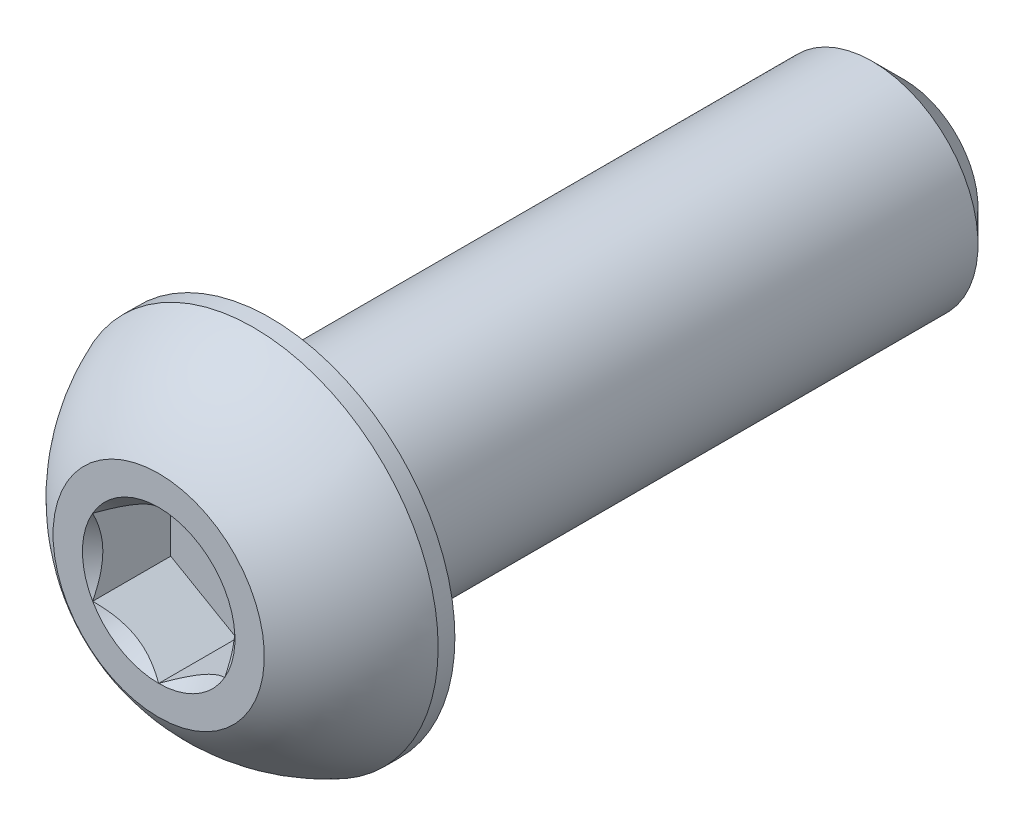
ISO-10303-21;
HEADER;
FILE_DESCRIPTION(('STEP AP214'),'2;1');
FILE_NAME('part.step','',(''),(''),'','','');
FILE_SCHEMA(('AUTOMOTIVE_DESIGN { 1 0 10303 214 1 1 1 1 }'));
ENDSEC;
DATA;
#1=APPLICATION_CONTEXT('core data for automotive mechanical design processes');
#2=APPLICATION_PROTOCOL_DEFINITION('international standard','automotive_design',2000,#1);
#3=PRODUCT_CONTEXT('',#1,'mechanical');
#4=PRODUCT('Part','Part','',(#3));
#5=PRODUCT_RELATED_PRODUCT_CATEGORY('part','',(#4));
#6=PRODUCT_DEFINITION_FORMATION('','',#4);
#7=PRODUCT_DEFINITION_CONTEXT('part definition',#1,'design');
#8=PRODUCT_DEFINITION('design','',#6,#7);
#9=PRODUCT_DEFINITION_SHAPE('','',#8);
#10=(LENGTH_UNIT() NAMED_UNIT(*) SI_UNIT(.MILLI.,.METRE.));
#11=(NAMED_UNIT(*) PLANE_ANGLE_UNIT() SI_UNIT($,.RADIAN.));
#12=(NAMED_UNIT(*) SI_UNIT($,.STERADIAN.) SOLID_ANGLE_UNIT());
#13=UNCERTAINTY_MEASURE_WITH_UNIT(LENGTH_MEASURE(1.E-05),#10,'distance_accuracy_value','');
#14=(GEOMETRIC_REPRESENTATION_CONTEXT(3) GLOBAL_UNCERTAINTY_ASSIGNED_CONTEXT((#13)) GLOBAL_UNIT_ASSIGNED_CONTEXT((#10,
#11,#12)) REPRESENTATION_CONTEXT('',''));
#15=CARTESIAN_POINT('',(0.,0.,0.));
#16=DIRECTION('',(0.,0.,1.));
#17=DIRECTION('',(1.,0.,0.));
#18=AXIS2_PLACEMENT_3D('',#15,#16,#17);
#19=CARTESIAN_POINT('',(0.,-3.17500000000001,-22.4028));
#20=DIRECTION('',(0.,0.,-1.));
#21=DIRECTION('',(0.,1.,0.));
#22=AXIS2_PLACEMENT_3D('',#19,#20,#21);
#23=PLANE('',#22);
#24=CARTESIAN_POINT('',(0.,0.,-22.4028));
#25=DIRECTION('',(0.,0.,-1.));
#26=DIRECTION('',(0.,1.,0.));
#27=AXIS2_PLACEMENT_3D('',#24,#25,#26);
#28=CIRCLE('',#27,2.2225);
#29=CARTESIAN_POINT('',(0.,2.2225,-22.4028));
#30=VERTEX_POINT('',#29);
#31=EDGE_CURVE('E174',#30,#30,#28,.T.);
#32=ORIENTED_EDGE('',*,*,#31,.T.);
#33=EDGE_LOOP('',(#32));
#34=FACE_BOUND('',#33,.T.);
#35=ADVANCED_FACE('F34',(#34),#23,.T.);
#36=CARTESIAN_POINT('',(0.,0.,-22.4028));
#37=DIRECTION('',(0.,0.,-1.));
#38=DIRECTION('',(0.,1.,0.));
#39=AXIS2_PLACEMENT_3D('',#36,#37,#38);
#40=CYLINDRICAL_SURFACE('',#39,3.175);
#41=CARTESIAN_POINT('',(0.,0.,-21.4503));
#42=DIRECTION('',(0.,0.,-1.));
#43=DIRECTION('',(0.,1.,0.));
#44=AXIS2_PLACEMENT_3D('',#41,#42,#43);
#45=CIRCLE('',#44,3.175);
#46=CARTESIAN_POINT('',(0.,3.175,-21.4503));
#47=VERTEX_POINT('',#46);
#48=EDGE_CURVE('E48',#47,#47,#45,.F.);
#49=ORIENTED_EDGE('',*,*,#48,.T.);
#50=EDGE_LOOP('',(#49));
#51=FACE_BOUND('',#50,.T.);
#52=CARTESIAN_POINT('',(0.,0.,-3.3528));
#53=DIRECTION('',(0.,0.,1.));
#54=DIRECTION('',(1.,0.,0.));
#55=AXIS2_PLACEMENT_3D('',#52,#53,#54);
#56=CIRCLE('',#55,3.175);
#57=CARTESIAN_POINT('',(3.175,0.,-3.3528));
#58=VERTEX_POINT('',#57);
#59=EDGE_CURVE('E171',#58,#58,#56,.F.);
#60=ORIENTED_EDGE('',*,*,#59,.T.);
#61=EDGE_LOOP('',(#60));
#62=FACE_BOUND('',#61,.T.);
#63=ADVANCED_FACE('F179',(#51,#62),#40,.T.);
#64=CARTESIAN_POINT('',(0.,0.,-22.4028));
#65=DIRECTION('',(0.,0.,1.));
#66=DIRECTION('',(0.,-1.,0.));
#67=AXIS2_PLACEMENT_3D('',#64,#65,#66);
#68=CONICAL_SURFACE('',#67,2.2225,0.785398163397447);
#69=ORIENTED_EDGE('',*,*,#48,.F.);
#70=EDGE_LOOP('',(#69));
#71=FACE_BOUND('',#70,.T.);
#72=ORIENTED_EDGE('',*,*,#31,.F.);
#73=EDGE_LOOP('',(#72));
#74=FACE_BOUND('',#73,.T.);
#75=ADVANCED_FACE('F36',(#71,#74),#68,.T.);
#76=CARTESIAN_POINT('',(0.,0.,-5.060315));
#77=DIRECTION('',(0.,0.,1.));
#78=DIRECTION('',(0.,-1.,0.));
#79=AXIS2_PLACEMENT_3D('',#76,#77,#78);
#80=SPHERICAL_SURFACE('',#79,5.97389428256184);
#81=CARTESIAN_POINT('',(0.,0.,0.));
#82=DIRECTION('',(0.,0.,1.));
#83=DIRECTION('',(1.,0.,0.));
#84=AXIS2_PLACEMENT_3D('',#81,#82,#83);
#85=CIRCLE('',#84,3.175);
#86=CARTESIAN_POINT('',(0.,-3.175,0.));
#87=VERTEX_POINT('',#86);
#88=EDGE_CURVE('E168',#87,#87,#85,.T.);
#89=CARTESIAN_POINT('',(0.,0.,-2.84988));
#90=DIRECTION('',(0.,0.,1.));
#91=DIRECTION('',(1.,0.,0.));
#92=AXIS2_PLACEMENT_3D('',#89,#90,#91);
#93=CIRCLE('',#92,5.5499);
#94=CARTESIAN_POINT('',(0.,-5.5499,-2.84988));
#95=VERTEX_POINT('',#94);
#96=EDGE_CURVE('E162',#95,#95,#93,.T.);
#97=CARTESIAN_POINT('',(0.,-3.175,0.));
#98=CARTESIAN_POINT('',(0.,-3.20828343957184,-0.0208830076580502));
#99=CARTESIAN_POINT('',(0.,-3.24136078860705,-0.0420944789280503));
#100=CARTESIAN_POINT('',(0.,-3.30709055775141,-0.0851658910984718));
#101=CARTESIAN_POINT('',(0.,-3.33974297786056,-0.107025831998893));
#102=CARTESIAN_POINT('',(0.,-3.40461014130008,-0.151385725836676));
#103=CARTESIAN_POINT('',(0.,-3.43682488463043,-0.173885678774039));
#104=CARTESIAN_POINT('',(0.,-3.50080416139461,-0.219516822259479));
#105=CARTESIAN_POINT('',(0.,-3.53256869482844,-0.242648012807557));
#106=CARTESIAN_POINT('',(0.,-3.59563518208834,-0.289532629449102));
#107=CARTESIAN_POINT('',(0.,-3.62693713591442,-0.313286055542569));
#108=CARTESIAN_POINT('',(0.,-3.68906627753106,-0.36140589409133));
#109=CARTESIAN_POINT('',(0.,-3.71989346532163,-0.385772306546626));
#110=CARTESIAN_POINT('',(0.,-3.78106107243204,-0.435108631276877));
#111=CARTESIAN_POINT('',(0.,-3.8114014917519,-0.460078543551833));
#112=CARTESIAN_POINT('',(0.,-3.87158374923259,-0.510612146063938));
#113=CARTESIAN_POINT('',(0.,-3.90142558739343,-0.536175836301086));
#114=CARTESIAN_POINT('',(0.,-3.96059906392414,-0.587887041792083));
#115=CARTESIAN_POINT('',(0.,-3.989930702294,-0.614034557045931));
#116=CARTESIAN_POINT('',(0.,-4.04807235926832,-0.666903232293407));
#117=CARTESIAN_POINT('',(0.,-4.07688237787279,-0.693624392287034));
#118=CARTESIAN_POINT('',(0.,-4.13396957842491,-0.747629953401057));
#119=CARTESIAN_POINT('',(0.,-4.16224676037257,-0.774914354521453));
#120=CARTESIAN_POINT('',(0.,-4.21825727817542,-0.830035774981947));
#121=CARTESIAN_POINT('',(0.,-4.24599061403061,-0.857872794322045));
#122=CARTESIAN_POINT('',(0.,-4.30090264195357,-0.91408861315902));
#123=CARTESIAN_POINT('',(0.,-4.32808133402134,-0.942467412655899));
#124=CARTESIAN_POINT('',(0.,-4.38187349261953,-0.999755742806741));
#125=CARTESIAN_POINT('',(0.,-4.40848695914995,-1.0286652734607));
#126=CARTESIAN_POINT('',(0.,-4.46113830498838,-1.08700381029123));
#127=CARTESIAN_POINT('',(0.,-4.48717618429639,-1.11643281646778));
#128=CARTESIAN_POINT('',(0.,-4.53866621810402,-1.17579884645643));
#129=CARTESIAN_POINT('',(0.,-4.56411837260364,-1.20573587026853));
#130=CARTESIAN_POINT('',(0.,-4.61442704725457,-1.26610627984964));
#131=CARTESIAN_POINT('',(0.,-4.63928356740587,-1.29653966561866));
#132=CARTESIAN_POINT('',(0.,-4.68839129572448,-1.3578909501815));
#133=CARTESIAN_POINT('',(0.,-4.71264250389178,-1.38880884897531));
#134=CARTESIAN_POINT('',(0.,-4.76053016627881,-1.45111712201534));
#135=CARTESIAN_POINT('',(0.,-4.78416662049853,-1.48250749626155));
#136=CARTESIAN_POINT('',(0.,-4.8308155723751,-1.54574849868041));
#137=CARTESIAN_POINT('',(0.,-4.85382807003194,-1.57759912685306));
#138=CARTESIAN_POINT('',(0.,-4.89922014909859,-1.64174823640362));
#139=CARTESIAN_POINT('',(0.,-4.92159973050841,-1.67404671778154));
#140=CARTESIAN_POINT('',(0.,-4.96571726381658,-1.73907895865427));
#141=CARTESIAN_POINT('',(0.,-4.98745521571493,-1.77181271814908));
#142=CARTESIAN_POINT('',(0.,-5.03028102654719,-1.83770277069632));
#143=CARTESIAN_POINT('',(0.,-5.0513688854811,-1.87085906374874));
#144=CARTESIAN_POINT('',(0.,-5.09288630004063,-1.93758127434189));
#145=CARTESIAN_POINT('',(0.,-5.11331585566624,-1.97114719188261));
#146=CARTESIAN_POINT('',(0.,-5.15350870956168,-2.03867558290299));
#147=CARTESIAN_POINT('',(0.,-5.17327200783151,-2.07263805638265));
#148=CARTESIAN_POINT('',(0.,-5.21212465239608,-2.14094633632486));
#149=CARTESIAN_POINT('',(0.,-5.23121399869082,-2.17529214278741));
#150=CARTESIAN_POINT('',(0.,-5.26871130697935,-2.2443537165359));
#151=CARTESIAN_POINT('',(0.,-5.28711926897315,-2.27906948382184));
#152=CARTESIAN_POINT('',(0.,-5.32324664200827,-2.3488574628552));
#153=CARTESIAN_POINT('',(0.,-5.3409660530496,-2.38392967460262));
#154=CARTESIAN_POINT('',(0.,-5.37570942417474,-2.45441688802313));
#155=CARTESIAN_POINT('',(0.,-5.39273338425856,-2.48983188969622));
#156=CARTESIAN_POINT('',(0.,-5.42607922958184,-2.56099089271574));
#157=CARTESIAN_POINT('',(0.,-5.44240111482132,-2.59673489406217));
#158=CARTESIAN_POINT('',(0.,-5.47433643994316,-2.66853798649801));
#159=CARTESIAN_POINT('',(0.,-5.48994987982553,-2.70459707758742));
#160=CARTESIAN_POINT('',(0.,-5.52046229408188,-2.77701628549785));
#161=CARTESIAN_POINT('',(0.,-5.53536126845586,-2.81337640231887));
#162=CARTESIAN_POINT('',(0.,-5.5499,-2.84988));
#163=B_SPLINE_CURVE_WITH_KNOTS('',3,(#97,#98,#99,#100,#101,#102,#103,#104,#105,#106,#107,#108,
#109,#110,#111,#112,#113,#114,#115,#116,#117,#118,#119,#120,#121,#122,#123,#124,#125,#126,#127,
#128,#129,#130,#131,#132,#133,#134,#135,#136,#137,#138,#139,#140,#141,#142,#143,#144,#145,#146,
#147,#148,#149,#150,#151,#152,#153,#154,#155,#156,#157,#158,#159,#160,#161,#162),.UNSPECIFIED.,
.F.,.F.,(4,2,2,2,2,2,2,2,2,2,2,2,2,2,2,2,2,2,2,2,2,2,2,2,2,2,2,2,2,2,2,2,4),(0.,0.1178750807537,
0.235750161507399,0.353625242261099,0.471500323014798,0.589375403768498,0.707250484522198,
0.825125565275897,0.943000646029597,1.0608757267833,1.17875080753699,1.2966258882907,
1.41450096904439,1.53237604979809,1.65025113055179,1.76812621130549,1.88600129205919,
2.00387637281289,2.12175145356659,2.23962653432029,2.35750161507399,2.47537669582769,
2.59325177658139,2.71112685733509,2.82900193808879,2.94687701884249,3.06475209959619,
3.18262718034989,3.30050226110359,3.41837734185729,3.53625242261099,3.65412750336469,
3.77200258411839),.UNSPECIFIED.);
#164=EDGE_CURVE('BSEAM184',#87,#95,#163,.T.);
#165=ORIENTED_EDGE('',*,*,#88,.F.);
#166=ORIENTED_EDGE('',*,*,#96,.T.);
#167=ORIENTED_EDGE('',*,*,#164,.T.);
#168=ORIENTED_EDGE('',*,*,#164,.F.);
#169=EDGE_LOOP('',(#165,#167,#166,#168));
#170=FACE_BOUND('',#169,.T.);
#171=ADVANCED_FACE('F184',(#170),#80,.T.);
#172=CARTESIAN_POINT('',(0.,-3.175,0.));
#173=DIRECTION('',(0.,0.,-1.));
#174=DIRECTION('',(-1.,0.,0.));
#175=AXIS2_PLACEMENT_3D('',#172,#173,#174);
#176=PLANE('',#175);
#177=CARTESIAN_POINT('',(0.,0.,0.));
#178=DIRECTION('',(0.,0.,1.));
#179=DIRECTION('',(1.,0.,0.));
#180=AXIS2_PLACEMENT_3D('',#177,#178,#179);
#181=CIRCLE('',#180,2.29135888084633);
#182=CARTESIAN_POINT('',(-1.984375,1.14567944042316,0.));
#183=VERTEX_POINT('',#182);
#184=CARTESIAN_POINT('',(-1.984375,-1.14567944042316,0.));
#185=VERTEX_POINT('',#184);
#186=EDGE_CURVE('E61',#183,#185,#181,.T.);
#187=ORIENTED_EDGE('',*,*,#186,.F.);
#188=CARTESIAN_POINT('',(0.,2.29135888084633,0.));
#189=VERTEX_POINT('',#188);
#190=EDGE_CURVE('E133',#189,#183,#181,.T.);
#191=ORIENTED_EDGE('',*,*,#190,.F.);
#192=CARTESIAN_POINT('',(1.984375,1.14567944042316,0.));
#193=VERTEX_POINT('',#192);
#194=EDGE_CURVE('E130',#193,#189,#181,.T.);
#195=ORIENTED_EDGE('',*,*,#194,.F.);
#196=CARTESIAN_POINT('',(1.984375,-1.14567944042316,0.));
#197=VERTEX_POINT('',#196);
#198=EDGE_CURVE('E101',#197,#193,#181,.T.);
#199=ORIENTED_EDGE('',*,*,#198,.F.);
#200=CARTESIAN_POINT('',(0.,-2.29135888084633,0.));
#201=VERTEX_POINT('',#200);
#202=EDGE_CURVE('E93',#201,#197,#181,.T.);
#203=ORIENTED_EDGE('',*,*,#202,.F.);
#204=EDGE_CURVE('E54',#185,#201,#181,.T.);
#205=ORIENTED_EDGE('',*,*,#204,.F.);
#206=EDGE_LOOP('',(#187,#191,#195,#199,#203,#205));
#207=FACE_BOUND('',#206,.T.);
#208=ORIENTED_EDGE('',*,*,#88,.T.);
#209=EDGE_LOOP('',(#208));
#210=FACE_BOUND('',#209,.T.);
#211=ADVANCED_FACE('F127',(#207,#210),#176,.F.);
#212=CARTESIAN_POINT('',(0.,-5.5499,-3.3528));
#213=DIRECTION('',(0.,0.,1.));
#214=DIRECTION('',(1.,0.,0.));
#215=AXIS2_PLACEMENT_3D('',#212,#213,#214);
#216=PLANE('',#215);
#217=ORIENTED_EDGE('',*,*,#59,.F.);
#218=EDGE_LOOP('',(#217));
#219=FACE_BOUND('',#218,.T.);
#220=CARTESIAN_POINT('',(0.,0.,-3.3528));
#221=DIRECTION('',(0.,0.,1.));
#222=DIRECTION('',(1.,0.,0.));
#223=AXIS2_PLACEMENT_3D('',#220,#221,#222);
#224=CIRCLE('',#223,5.5499);
#225=CARTESIAN_POINT('',(5.5499,0.,-3.3528));
#226=VERTEX_POINT('',#225);
#227=EDGE_CURVE('E165',#226,#226,#224,.T.);
#228=ORIENTED_EDGE('',*,*,#227,.F.);
#229=EDGE_LOOP('',(#228));
#230=FACE_BOUND('',#229,.T.);
#231=ADVANCED_FACE('F198',(#219,#230),#216,.F.);
#232=CARTESIAN_POINT('',(0.,0.,0.));
#233=DIRECTION('',(0.,0.,1.));
#234=DIRECTION('',(1.,0.,0.));
#235=AXIS2_PLACEMENT_3D('',#232,#233,#234);
#236=CYLINDRICAL_SURFACE('',#235,5.5499);
#237=ORIENTED_EDGE('',*,*,#96,.F.);
#238=EDGE_LOOP('',(#237));
#239=FACE_BOUND('',#238,.T.);
#240=ORIENTED_EDGE('',*,*,#227,.T.);
#241=EDGE_LOOP('',(#240));
#242=FACE_BOUND('',#241,.T.);
#243=ADVANCED_FACE('F201',(#239,#242),#236,.T.);
#244=CARTESIAN_POINT('',(0.,0.,0.));
#245=DIRECTION('',(0.,0.,1.));
#246=DIRECTION('',(1.,0.,0.));
#247=AXIS2_PLACEMENT_3D('',#244,#245,#246);
#248=CONICAL_SURFACE('',#247,2.29135888084633,0.78539816339745);
#249=ORIENTED_EDGE('',*,*,#198,.T.);
#250=CARTESIAN_POINT('',(1.984375,-2.28495242157822,0.734984078816568));
#251=CARTESIAN_POINT('',(1.984375,-2.22931635455402,0.692986685550762));
#252=CARTESIAN_POINT('',(1.984375,-2.17336876548389,0.651396054076336));
#253=CARTESIAN_POINT('',(1.984375,-2.06072770258171,0.569208461471479));
#254=CARTESIAN_POINT('',(1.984375,-2.00403404503435,0.528611752405042));
#255=CARTESIAN_POINT('',(1.984375,-1.88936329173488,0.448303503174668));
#256=CARTESIAN_POINT('',(1.984375,-1.83137965519348,0.408601258813307));
#257=CARTESIAN_POINT('',(1.984375,-1.7144280213784,0.330685173401292));
#258=CARTESIAN_POINT('',(1.984375,-1.65546009407228,0.292471227194368));
#259=CARTESIAN_POINT('',(1.984375,-1.47005472306035,0.176252834013637));
#260=CARTESIAN_POINT('',(1.984375,-1.34163909427883,0.101347886872381));
#261=CARTESIAN_POINT('',(1.984375,-1.0784038470548,-0.0356697845602627));
#262=CARTESIAN_POINT('',(1.984375,-0.943607781407424,-0.0978256335176254));
#263=CARTESIAN_POINT('',(1.984375,-0.741275100444881,-0.173867421311381));
#264=CARTESIAN_POINT('',(1.984375,-0.676735408881095,-0.195691938673995));
#265=CARTESIAN_POINT('',(1.984375,-0.546098118112761,-0.234159536462205));
#266=CARTESIAN_POINT('',(1.984375,-0.480000411919955,-0.250802259934452));
#267=CARTESIAN_POINT('',(1.984375,-0.347746170028531,-0.277764619130277));
#268=CARTESIAN_POINT('',(1.984375,-0.281612071479122,-0.288192590264109));
#269=CARTESIAN_POINT('',(1.984375,-0.14863662005235,-0.302521852623404));
#270=CARTESIAN_POINT('',(1.984375,-0.0817953907393235,-0.306424265772614));
#271=CARTESIAN_POINT('',(1.984375,0.0495156750890644,-0.307412948667327));
#272=CARTESIAN_POINT('',(1.984375,0.113983775102991,-0.304740821124985));
#273=CARTESIAN_POINT('',(1.984375,0.242367515846177,-0.293260789502485));
#274=CARTESIAN_POINT('',(1.984375,0.30628310229592,-0.284452289360786));
#275=CARTESIAN_POINT('',(1.984375,0.434181040262184,-0.261030978667103));
#276=CARTESIAN_POINT('',(1.984375,0.498145026858309,-0.246319393767914));
#277=CARTESIAN_POINT('',(1.984375,0.624675616953007,-0.211873818587874));
#278=CARTESIAN_POINT('',(1.984375,0.687242336899689,-0.192140248550805));
#279=CARTESIAN_POINT('',(1.984375,0.884225483826088,-0.12258776276924));
#280=CARTESIAN_POINT('',(1.984375,1.01583674256468,-0.0648475887435034));
#281=CARTESIAN_POINT('',(1.984375,1.27288659242652,0.063530336588798));
#282=CARTESIAN_POINT('',(1.984375,1.3983008827048,0.134214424919413));
#283=CARTESIAN_POINT('',(1.984375,1.57956687990221,0.244516663813199));
#284=CARTESIAN_POINT('',(1.984375,1.63738271299424,0.280969829475364));
#285=CARTESIAN_POINT('',(1.984375,1.75202215386202,0.355415963291705));
#286=CARTESIAN_POINT('',(1.984375,1.80884568601362,0.393409048078054));
#287=CARTESIAN_POINT('',(1.984375,1.92116923084255,0.470338808893091));
#288=CARTESIAN_POINT('',(1.984375,1.97667624512253,0.509265313038791));
#289=CARTESIAN_POINT('',(1.984375,2.08693170717166,0.588147746121386));
#290=CARTESIAN_POINT('',(1.984375,2.14168035934793,0.62810338902403));
#291=CARTESIAN_POINT('',(1.984375,2.19611149046622,0.668480611285427));
#292=B_SPLINE_CURVE_WITH_KNOTS('',3,(#250,#251,#252,#253,#254,#255,#256,#257,#258,#259,#260,
#261,#262,#263,#264,#265,#266,#267,#268,#269,#270,#271,#272,#273,#274,#275,#276,#277,#278,#279,
#280,#281,#282,#283,#284,#285,#286,#287,#288,#289,#290,#291),.UNSPECIFIED.,.F.,.F.,(4,2,2,2,2,2,
2,2,2,2,2,2,2,2,2,2,2,2,2,2,4),(0.,0.209126070008322,0.418304637356569,0.629103979977992,
0.839888401371185,1.28549951116127,1.72957750768351,1.93379389749971,2.13802435186698,
2.33858179514334,2.53910475350639,2.73236963400794,2.92565329006887,3.12231577097487,
3.31896180041345,3.74886295245172,4.18033428125362,4.3853601718029,4.59040161996383,
4.79377749165108,4.99709743524131),.UNSPECIFIED.);
#293=EDGE_CURVE('E11',#197,#193,#292,.T.);
#294=ORIENTED_EDGE('',*,*,#293,.F.);
#295=EDGE_LOOP('',(#249,#294));
#296=FACE_BOUND('',#295,.T.);
#297=ADVANCED_FACE('F105',(#296),#248,.F.);
#298=ORIENTED_EDGE('',*,*,#194,.T.);
#299=CARTESIAN_POINT('',(1.984575,1.14556397036933,0.000115478781843379));
#300=CARTESIAN_POINT('',(1.9163590048332,1.18494849354192,-0.0392371477360855));
#301=CARTESIAN_POINT('',(1.84700231489303,1.22499159714897,-0.0762786895538155));
#302=CARTESIAN_POINT('',(1.70557619954781,1.30664400291398,-0.144101141576677));
#303=CARTESIAN_POINT('',(1.63349332126322,1.34826107209555,-0.174844310908246));
#304=CARTESIAN_POINT('',(1.488141602734,1.43217992591557,-0.227508111188786));
#305=CARTESIAN_POINT('',(1.41490978751306,1.47446033414663,-0.249561124120036));
#306=CARTESIAN_POINT('',(1.26683381740529,1.55995203534886,-0.283538507056124));
#307=CARTESIAN_POINT('',(1.19199418724658,1.60316071596705,-0.295488243908271));
#308=CARTESIAN_POINT('',(1.06301458545618,1.6776271237807,-0.306269900918094));
#309=CARTESIAN_POINT('',(1.00904128422756,1.7087886237741,-0.30786610094093));
#310=CARTESIAN_POINT('',(0.901182881480199,1.77106070163465,-0.305178161134708));
#311=CARTESIAN_POINT('',(0.847297817514476,1.80217125782056,-0.300891959659541));
#312=CARTESIAN_POINT('',(0.740036461751395,1.86409863044402,-0.286683126986481));
#313=CARTESIAN_POINT('',(0.686660807239859,1.89491507894443,-0.276754189547727));
#314=CARTESIAN_POINT('',(0.580832482591103,1.95601509066828,-0.251804915725461));
#315=CARTESIAN_POINT('',(0.528379742028898,1.9862986945516,-0.236784969610512));
#316=CARTESIAN_POINT('',(0.394017661036351,2.06387267818152,-0.19219214836433));
#317=CARTESIAN_POINT('',(0.312941642841675,2.11068193911104,-0.159257004061667));
#318=CARTESIAN_POINT('',(0.19372669327016,2.17951072233758,-0.103657558797803));
#319=CARTESIAN_POINT('',(0.154440075613998,2.20219286161692,-0.0841224079481375));
#320=CARTESIAN_POINT('',(0.0765946381319467,2.24713694590237,-0.0432712618805984));
#321=CARTESIAN_POINT('',(0.0380353888983008,2.26939913882716,-0.0219563604316496));
#322=CARTESIAN_POINT('',(-0.00020000000000058,2.29147435090017,0.000115478781842942));
#323=B_SPLINE_CURVE_WITH_KNOTS('',3,(#299,#300,#301,#302,#303,#304,#305,#306,#307,#308,#309,
#310,#311,#312,#313,#314,#315,#316,#317,#318,#319,#320,#321,#322),.UNSPECIFIED.,.F.,.F.,(4,2,2,
2,2,2,2,2,2,2,2,4),(0.,0.264339630306627,0.530219665093694,0.79187641637146,1.05287424418109,
1.239639843932,1.42647091743852,1.61351120244035,1.8005371524754,2.09764209964316,
2.24579179873714,2.39385111134157),.UNSPECIFIED.);
#324=EDGE_CURVE('E132',#193,#189,#323,.T.);
#325=ORIENTED_EDGE('',*,*,#324,.F.);
#326=EDGE_LOOP('',(#298,#325));
#327=FACE_BOUND('',#326,.T.);
#328=ADVANCED_FACE('F286',(#327),#248,.F.);
#329=ORIENTED_EDGE('',*,*,#190,.T.);
#330=CARTESIAN_POINT('',(0.000199999999999608,2.29147435090017,0.000115478781843248));
#331=CARTESIAN_POINT('',(-0.0680159951668025,2.25208982772757,-0.0392371477360854));
#332=CARTESIAN_POINT('',(-0.137372685106966,2.21204672412052,-0.0762786895538155));
#333=CARTESIAN_POINT('',(-0.278798800452188,2.13039431835551,-0.144101141576677));
#334=CARTESIAN_POINT('',(-0.350881678736783,2.08877724917394,-0.174844310908246));
#335=CARTESIAN_POINT('',(-0.496233397266004,2.00485839535392,-0.227508111188786));
#336=CARTESIAN_POINT('',(-0.569465212486939,1.96257798712287,-0.249561124120036));
#337=CARTESIAN_POINT('',(-0.717541182594707,1.87708628592063,-0.283538507056124));
#338=CARTESIAN_POINT('',(-0.792380812753425,1.83387760530244,-0.295488243908272));
#339=CARTESIAN_POINT('',(-0.921360414543816,1.75941119748879,-0.306269900918094));
#340=CARTESIAN_POINT('',(-0.975333715772443,1.72824969749539,-0.307866100940931));
#341=CARTESIAN_POINT('',(-1.0831921185198,1.66597761963484,-0.305178161134708));
#342=CARTESIAN_POINT('',(-1.13707718248552,1.63486706344893,-0.300891959659541));
#343=CARTESIAN_POINT('',(-1.2443385382486,1.57293969082547,-0.286683126986481));
#344=CARTESIAN_POINT('',(-1.29771419276014,1.54212324232506,-0.276754189547727));
#345=CARTESIAN_POINT('',(-1.4035425174089,1.48102323060122,-0.251804915725462));
#346=CARTESIAN_POINT('',(-1.4559952579711,1.45073962671789,-0.236784969610512));
#347=CARTESIAN_POINT('',(-1.59035733896365,1.37316564308797,-0.19219214836433));
#348=CARTESIAN_POINT('',(-1.67143335715832,1.32635638215845,-0.159257004061668));
#349=CARTESIAN_POINT('',(-1.79064830672984,1.25752759893191,-0.103657558797804));
#350=CARTESIAN_POINT('',(-1.829934924386,1.23484545965257,-0.0841224079481378));
#351=CARTESIAN_POINT('',(-1.90778036186805,1.18990137536712,-0.0432712618805986));
#352=CARTESIAN_POINT('',(-1.9463396111017,1.16763918244233,-0.0219563604316498));
#353=CARTESIAN_POINT('',(-1.984575,1.14556397036933,0.000115478781842511));
#354=B_SPLINE_CURVE_WITH_KNOTS('',3,(#330,#331,#332,#333,#334,#335,#336,#337,#338,#339,#340,
#341,#342,#343,#344,#345,#346,#347,#348,#349,#350,#351,#352,#353),.UNSPECIFIED.,.F.,.F.,(4,2,2,
2,2,2,2,2,2,2,2,4),(0.,0.264339630306627,0.530219665093694,0.791876416371461,1.05287424418109,
1.239639843932,1.42647091743852,1.61351120244035,1.8005371524754,2.09764209964316,
2.24579179873714,2.39385111134157),.UNSPECIFIED.);
#355=EDGE_CURVE('E137',#189,#183,#354,.T.);
#356=ORIENTED_EDGE('',*,*,#355,.F.);
#357=EDGE_LOOP('',(#329,#356));
#358=FACE_BOUND('',#357,.T.);
#359=ADVANCED_FACE('F140',(#358),#248,.F.);
#360=ORIENTED_EDGE('',*,*,#186,.T.);
#361=CARTESIAN_POINT('',(-1.984375,-2.28495242157823,0.734984078816569));
#362=CARTESIAN_POINT('',(-1.984375,-2.22931635455402,0.692986685550762));
#363=CARTESIAN_POINT('',(-1.984375,-2.17336876548389,0.651396054076336));
#364=CARTESIAN_POINT('',(-1.984375,-2.06072770258171,0.56920846147148));
#365=CARTESIAN_POINT('',(-1.984375,-2.00403404503435,0.528611752405043));
#366=CARTESIAN_POINT('',(-1.984375,-1.88936329173489,0.448303503174669));
#367=CARTESIAN_POINT('',(-1.984375,-1.83137965519348,0.408601258813308));
#368=CARTESIAN_POINT('',(-1.984375,-1.7144280213784,0.330685173401292));
#369=CARTESIAN_POINT('',(-1.984375,-1.65546009407228,0.292471227194368));
#370=CARTESIAN_POINT('',(-1.984375,-1.47005472306035,0.176252834013636));
#371=CARTESIAN_POINT('',(-1.984375,-1.34163909427883,0.101347886872382));
#372=CARTESIAN_POINT('',(-1.984375,-1.0784038470548,-0.0356697845602624));
#373=CARTESIAN_POINT('',(-1.984375,-0.943607781407425,-0.0978256335176256));
#374=CARTESIAN_POINT('',(-1.984375,-0.741275100444882,-0.173867421311381));
#375=CARTESIAN_POINT('',(-1.984375,-0.676735408881095,-0.195691938673995));
#376=CARTESIAN_POINT('',(-1.984375,-0.546098118112762,-0.234159536462205));
#377=CARTESIAN_POINT('',(-1.984375,-0.480000411919956,-0.250802259934452));
#378=CARTESIAN_POINT('',(-1.984375,-0.347746170028532,-0.277764619130277));
#379=CARTESIAN_POINT('',(-1.984375,-0.281612071479123,-0.288192590264108));
#380=CARTESIAN_POINT('',(-1.984375,-0.14863662005235,-0.302521852623404));
#381=CARTESIAN_POINT('',(-1.984375,-0.0817953907393237,-0.306424265772614));
#382=CARTESIAN_POINT('',(-1.984375,0.0495156750890643,-0.307412948667328));
#383=CARTESIAN_POINT('',(-1.984375,0.113983775102991,-0.304740821124985));
#384=CARTESIAN_POINT('',(-1.984375,0.242367515846177,-0.293260789502485));
#385=CARTESIAN_POINT('',(-1.984375,0.306283102295919,-0.284452289360786));
#386=CARTESIAN_POINT('',(-1.984375,0.434181040262184,-0.261030978667103));
#387=CARTESIAN_POINT('',(-1.984375,0.498145026858309,-0.246319393767914));
#388=CARTESIAN_POINT('',(-1.984375,0.624675616953007,-0.211873818587874));
#389=CARTESIAN_POINT('',(-1.984375,0.687242336899689,-0.192140248550805));
#390=CARTESIAN_POINT('',(-1.984375,0.884225483826087,-0.12258776276924));
#391=CARTESIAN_POINT('',(-1.984375,1.01583674256468,-0.0648475887435036));
#392=CARTESIAN_POINT('',(-1.984375,1.27288659242652,0.0635303365887976));
#393=CARTESIAN_POINT('',(-1.984375,1.3983008827048,0.134214424919412));
#394=CARTESIAN_POINT('',(-1.984375,1.57956687990221,0.244516663813198));
#395=CARTESIAN_POINT('',(-1.984375,1.63738271299424,0.280969829475363));
#396=CARTESIAN_POINT('',(-1.984375,1.75202215386202,0.355415963291704));
#397=CARTESIAN_POINT('',(-1.984375,1.80884568601362,0.393409048078054));
#398=CARTESIAN_POINT('',(-1.984375,1.92116923084255,0.47033880889309));
#399=CARTESIAN_POINT('',(-1.984375,1.97667624512253,0.509265313038791));
#400=CARTESIAN_POINT('',(-1.984375,2.08693170717166,0.588147746121386));
#401=CARTESIAN_POINT('',(-1.984375,2.14168035934793,0.628103389024029));
#402=CARTESIAN_POINT('',(-1.984375,2.19611149046622,0.668480611285426));
#403=B_SPLINE_CURVE_WITH_KNOTS('',3,(#361,#362,#363,#364,#365,#366,#367,#368,#369,#370,#371,
#372,#373,#374,#375,#376,#377,#378,#379,#380,#381,#382,#383,#384,#385,#386,#387,#388,#389,#390,
#391,#392,#393,#394,#395,#396,#397,#398,#399,#400,#401,#402),.UNSPECIFIED.,.F.,.F.,(4,2,2,2,2,2,
2,2,2,2,2,2,2,2,2,2,2,2,2,2,4),(0.,0.209126070008322,0.41830463735657,0.629103979977993,
0.839888401371186,1.28549951116127,1.72957750768351,1.93379389749972,2.13802435186698,
2.33858179514334,2.53910475350639,2.73236963400794,2.92565329006887,3.12231577097488,
3.31896180041345,3.74886295245172,4.18033428125362,4.3853601718029,4.59040161996383,
4.79377749165108,4.99709743524131),.UNSPECIFIED.);
#404=EDGE_CURVE('E144',#183,#185,#403,.F.);
#405=ORIENTED_EDGE('',*,*,#404,.F.);
#406=EDGE_LOOP('',(#360,#405));
#407=FACE_BOUND('',#406,.T.);
#408=ADVANCED_FACE('F280',(#407),#248,.F.);
#409=ORIENTED_EDGE('',*,*,#204,.T.);
#410=CARTESIAN_POINT('',(-1.984575,-1.14556397036933,0.000115478781843379));
#411=CARTESIAN_POINT('',(-1.9163590048332,-1.18494849354192,-0.0392371477360847));
#412=CARTESIAN_POINT('',(-1.84700231489303,-1.22499159714897,-0.0762786895538149));
#413=CARTESIAN_POINT('',(-1.70557619954781,-1.30664400291398,-0.144101141576677));
#414=CARTESIAN_POINT('',(-1.63349332126322,-1.34826107209555,-0.174844310908247));
#415=CARTESIAN_POINT('',(-1.488141602734,-1.43217992591557,-0.227508111188786));
#416=CARTESIAN_POINT('',(-1.41490978751306,-1.47446033414663,-0.249561124120036));
#417=CARTESIAN_POINT('',(-1.26683381740529,-1.55995203534886,-0.283538507056124));
#418=CARTESIAN_POINT('',(-1.19199418724658,-1.60316071596705,-0.295488243908271));
#419=CARTESIAN_POINT('',(-1.06301458545618,-1.6776271237807,-0.306269900918094));
#420=CARTESIAN_POINT('',(-1.00904128422756,-1.7087886237741,-0.30786610094093));
#421=CARTESIAN_POINT('',(-0.9011828814802,-1.77106070163465,-0.305178161134707));
#422=CARTESIAN_POINT('',(-0.847297817514477,-1.80217125782056,-0.30089195965954));
#423=CARTESIAN_POINT('',(-0.740036461751396,-1.86409863044402,-0.286683126986481));
#424=CARTESIAN_POINT('',(-0.68666080723986,-1.89491507894443,-0.276754189547727));
#425=CARTESIAN_POINT('',(-0.580832482591103,-1.95601509066828,-0.251804915725461));
#426=CARTESIAN_POINT('',(-0.528379742028898,-1.9862986945516,-0.236784969610511));
#427=CARTESIAN_POINT('',(-0.394017661036351,-2.06387267818152,-0.19219214836433));
#428=CARTESIAN_POINT('',(-0.312941642841675,-2.11068193911104,-0.159257004061667));
#429=CARTESIAN_POINT('',(-0.19372669327016,-2.17951072233758,-0.103657558797803));
#430=CARTESIAN_POINT('',(-0.154440075613998,-2.20219286161692,-0.0841224079481371));
#431=CARTESIAN_POINT('',(-0.0765946381319465,-2.24713694590237,-0.0432712618805977));
#432=CARTESIAN_POINT('',(-0.0380353888983009,-2.26939913882716,-0.0219563604316487));
#433=CARTESIAN_POINT('',(0.000200000000000425,-2.29147435090017,0.000115478781843735));
#434=B_SPLINE_CURVE_WITH_KNOTS('',3,(#410,#411,#412,#413,#414,#415,#416,#417,#418,#419,#420,
#421,#422,#423,#424,#425,#426,#427,#428,#429,#430,#431,#432,#433),.UNSPECIFIED.,.F.,.F.,(4,2,2,
2,2,2,2,2,2,2,2,4),(0.,0.264339630306627,0.530219665093694,0.79187641637146,1.05287424418109,
1.239639843932,1.42647091743852,1.61351120244035,1.8005371524754,2.09764209964316,
2.24579179873714,2.39385111134157),.UNSPECIFIED.);
#435=EDGE_CURVE('E117',#185,#201,#434,.T.);
#436=ORIENTED_EDGE('',*,*,#435,.F.);
#437=EDGE_LOOP('',(#409,#436));
#438=FACE_BOUND('',#437,.T.);
#439=ADVANCED_FACE('F228',(#438),#248,.F.);
#440=ORIENTED_EDGE('',*,*,#202,.T.);
#441=CARTESIAN_POINT('',(-0.000199999999999594,-2.29147435090017,0.000115478781843681));
#442=CARTESIAN_POINT('',(0.0680159951668032,-2.25208982772757,-0.0392371477360843));
#443=CARTESIAN_POINT('',(0.137372685106967,-2.21204672412052,-0.0762786895538144));
#444=CARTESIAN_POINT('',(0.278798800452188,-2.13039431835551,-0.144101141576676));
#445=CARTESIAN_POINT('',(0.350881678736783,-2.08877724917394,-0.174844310908246));
#446=CARTESIAN_POINT('',(0.496233397266004,-2.00485839535392,-0.227508111188787));
#447=CARTESIAN_POINT('',(0.569465212486939,-1.96257798712287,-0.249561124120036));
#448=CARTESIAN_POINT('',(0.717541182594707,-1.87708628592063,-0.283538507056124));
#449=CARTESIAN_POINT('',(0.792380812753425,-1.83387760530244,-0.295488243908272));
#450=CARTESIAN_POINT('',(0.921360414543816,-1.75941119748879,-0.306269900918094));
#451=CARTESIAN_POINT('',(0.975333715772443,-1.72824969749539,-0.30786610094093));
#452=CARTESIAN_POINT('',(1.0831921185198,-1.66597761963484,-0.305178161134708));
#453=CARTESIAN_POINT('',(1.13707718248552,-1.63486706344893,-0.300891959659541));
#454=CARTESIAN_POINT('',(1.2443385382486,-1.57293969082547,-0.286683126986481));
#455=CARTESIAN_POINT('',(1.29771419276014,-1.54212324232506,-0.276754189547727));
#456=CARTESIAN_POINT('',(1.4035425174089,-1.48102323060122,-0.251804915725462));
#457=CARTESIAN_POINT('',(1.4559952579711,-1.45073962671789,-0.236784969610512));
#458=CARTESIAN_POINT('',(1.59035733896365,-1.37316564308797,-0.19219214836433));
#459=CARTESIAN_POINT('',(1.67143335715832,-1.32635638215845,-0.159257004061668));
#460=CARTESIAN_POINT('',(1.79064830672984,-1.25752759893191,-0.103657558797804));
#461=CARTESIAN_POINT('',(1.829934924386,-1.23484545965257,-0.0841224079481379));
#462=CARTESIAN_POINT('',(1.90778036186805,-1.18990137536712,-0.0432712618805987));
#463=CARTESIAN_POINT('',(1.9463396111017,-1.16763918244233,-0.0219563604316498));
#464=CARTESIAN_POINT('',(1.984575,-1.14556397036933,0.000115478781842673));
#465=B_SPLINE_CURVE_WITH_KNOTS('',3,(#441,#442,#443,#444,#445,#446,#447,#448,#449,#450,#451,
#452,#453,#454,#455,#456,#457,#458,#459,#460,#461,#462,#463,#464),.UNSPECIFIED.,.F.,.F.,(4,2,2,
2,2,2,2,2,2,2,2,4),(0.,0.264339630306627,0.530219665093695,0.791876416371461,1.05287424418109,
1.239639843932,1.42647091743852,1.61351120244035,1.8005371524754,2.09764209964316,
2.24579179873714,2.39385111134157),.UNSPECIFIED.);
#466=EDGE_CURVE('E97',#201,#197,#465,.T.);
#467=ORIENTED_EDGE('',*,*,#466,.F.);
#468=EDGE_LOOP('',(#440,#467));
#469=FACE_BOUND('',#468,.T.);
#470=ADVANCED_FACE('F95',(#469),#248,.F.);
#471=CARTESIAN_POINT('',(1.984375,-1.14567944042316,-2.34696));
#472=DIRECTION('',(0.,0.,1.));
#473=DIRECTION('',(1.,0.,0.));
#474=AXIS2_PLACEMENT_3D('',#471,#472,#473);
#475=PLANE('',#474);
#476=DIRECTION('',(0.866025403784438,0.5,0.));
#477=VECTOR('',#476,1.);
#478=CARTESIAN_POINT('',(0.,-2.29135888084633,-2.34696));
#479=LINE('',#478,#477);
#480=CARTESIAN_POINT('',(0.,-2.29135888084633,-2.34696));
#481=VERTEX_POINT('',#480);
#482=CARTESIAN_POINT('',(1.984375,-1.14567944042316,-2.34696));
#483=VERTEX_POINT('',#482);
#484=EDGE_CURVE('E116',#481,#483,#479,.T.);
#485=ORIENTED_EDGE('',*,*,#484,.T.);
#486=DIRECTION('',(0.,1.,0.));
#487=VECTOR('',#486,1.);
#488=CARTESIAN_POINT('',(1.984375,-1.14567944042316,-2.34696));
#489=LINE('',#488,#487);
#490=CARTESIAN_POINT('',(1.984375,1.14567944042316,-2.34696));
#491=VERTEX_POINT('',#490);
#492=EDGE_CURVE('E121',#483,#491,#489,.T.);
#493=ORIENTED_EDGE('',*,*,#492,.T.);
#494=DIRECTION('',(-0.866025403784439,0.5,0.));
#495=VECTOR('',#494,1.);
#496=CARTESIAN_POINT('',(1.984375,1.14567944042316,-2.34696));
#497=LINE('',#496,#495);
#498=CARTESIAN_POINT('',(0.,2.29135888084633,-2.34696));
#499=VERTEX_POINT('',#498);
#500=EDGE_CURVE('E270',#491,#499,#497,.T.);
#501=ORIENTED_EDGE('',*,*,#500,.T.);
#502=DIRECTION('',(-0.866025403784438,-0.5,0.));
#503=VECTOR('',#502,1.);
#504=CARTESIAN_POINT('',(0.,2.29135888084633,-2.34696));
#505=LINE('',#504,#503);
#506=CARTESIAN_POINT('',(-1.984375,1.14567944042316,-2.34696));
#507=VERTEX_POINT('',#506);
#508=EDGE_CURVE('E153',#499,#507,#505,.T.);
#509=ORIENTED_EDGE('',*,*,#508,.T.);
#510=DIRECTION('',(0.,-1.,0.));
#511=VECTOR('',#510,1.);
#512=CARTESIAN_POINT('',(-1.984375,1.14567944042316,-2.34696));
#513=LINE('',#512,#511);
#514=CARTESIAN_POINT('',(-1.984375,-1.14567944042316,-2.34696));
#515=VERTEX_POINT('',#514);
#516=EDGE_CURVE('E274',#507,#515,#513,.T.);
#517=ORIENTED_EDGE('',*,*,#516,.T.);
#518=DIRECTION('',(0.866025403784439,-0.5,0.));
#519=VECTOR('',#518,1.);
#520=CARTESIAN_POINT('',(-1.984375,-1.14567944042316,-2.34696));
#521=LINE('',#520,#519);
#522=EDGE_CURVE('E124',#515,#481,#521,.T.);
#523=ORIENTED_EDGE('',*,*,#522,.T.);
#524=EDGE_LOOP('',(#485,#493,#501,#509,#517,#523));
#525=FACE_BOUND('',#524,.T.);
#526=ADVANCED_FACE('F227',(#525),#475,.T.);
#527=CARTESIAN_POINT('',(1.984375,-1.14567944042316,-2.34696));
#528=DIRECTION('',(1.,0.,0.));
#529=DIRECTION('',(0.,0.,-1.));
#530=AXIS2_PLACEMENT_3D('',#527,#528,#529);
#531=PLANE('',#530);
#532=DIRECTION('',(0.,0.,1.));
#533=VECTOR('',#532,1.);
#534=CARTESIAN_POINT('',(1.984375,-1.14567944042316,-2.34696));
#535=LINE('',#534,#533);
#536=EDGE_CURVE('E113',#483,#197,#535,.T.);
#537=ORIENTED_EDGE('',*,*,#536,.T.);
#538=ORIENTED_EDGE('',*,*,#293,.T.);
#539=DIRECTION('',(0.,0.,1.));
#540=VECTOR('',#539,1.);
#541=CARTESIAN_POINT('',(1.984375,1.14567944042316,-2.34696));
#542=LINE('',#541,#540);
#543=EDGE_CURVE('E123',#491,#193,#542,.T.);
#544=ORIENTED_EDGE('',*,*,#543,.F.);
#545=ORIENTED_EDGE('',*,*,#492,.F.);
#546=EDGE_LOOP('',(#537,#538,#544,#545));
#547=FACE_BOUND('',#546,.T.);
#548=ADVANCED_FACE('F119',(#547),#531,.F.);
#549=CARTESIAN_POINT('',(1.984375,1.14567944042316,-2.34696));
#550=DIRECTION('',(0.5,0.866025403784439,0.));
#551=DIRECTION('',(-0.866025403784439,0.5,0.));
#552=AXIS2_PLACEMENT_3D('',#549,#550,#551);
#553=PLANE('',#552);
#554=ORIENTED_EDGE('',*,*,#543,.T.);
#555=ORIENTED_EDGE('',*,*,#324,.T.);
#556=DIRECTION('',(0.,0.,1.));
#557=VECTOR('',#556,1.);
#558=CARTESIAN_POINT('',(0.,2.29135888084633,-2.34696));
#559=LINE('',#558,#557);
#560=EDGE_CURVE('E149',#499,#189,#559,.T.);
#561=ORIENTED_EDGE('',*,*,#560,.F.);
#562=ORIENTED_EDGE('',*,*,#500,.F.);
#563=EDGE_LOOP('',(#554,#555,#561,#562));
#564=FACE_BOUND('',#563,.T.);
#565=ADVANCED_FACE('F147',(#564),#553,.F.);
#566=CARTESIAN_POINT('',(0.,2.29135888084633,-2.34696));
#567=DIRECTION('',(-0.5,0.866025403784438,0.));
#568=DIRECTION('',(-0.866025403784438,-0.5,0.));
#569=AXIS2_PLACEMENT_3D('',#566,#567,#568);
#570=PLANE('',#569);
#571=ORIENTED_EDGE('',*,*,#560,.T.);
#572=ORIENTED_EDGE('',*,*,#355,.T.);
#573=DIRECTION('',(0.,0.,1.));
#574=VECTOR('',#573,1.);
#575=CARTESIAN_POINT('',(-1.984375,1.14567944042316,-2.34696));
#576=LINE('',#575,#574);
#577=EDGE_CURVE('E155',#507,#183,#576,.T.);
#578=ORIENTED_EDGE('',*,*,#577,.F.);
#579=ORIENTED_EDGE('',*,*,#508,.F.);
#580=EDGE_LOOP('',(#571,#572,#578,#579));
#581=FACE_BOUND('',#580,.T.);
#582=ADVANCED_FACE('F151',(#581),#570,.F.);
#583=CARTESIAN_POINT('',(-1.984375,1.14567944042316,-2.34696));
#584=DIRECTION('',(-1.,0.,0.));
#585=DIRECTION('',(0.,0.,1.));
#586=AXIS2_PLACEMENT_3D('',#583,#584,#585);
#587=PLANE('',#586);
#588=ORIENTED_EDGE('',*,*,#577,.T.);
#589=ORIENTED_EDGE('',*,*,#404,.T.);
#590=DIRECTION('',(0.,0.,1.));
#591=VECTOR('',#590,1.);
#592=CARTESIAN_POINT('',(-1.984375,-1.14567944042316,-2.34696));
#593=LINE('',#592,#591);
#594=EDGE_CURVE('E157',#515,#185,#593,.T.);
#595=ORIENTED_EDGE('',*,*,#594,.F.);
#596=ORIENTED_EDGE('',*,*,#516,.F.);
#597=EDGE_LOOP('',(#588,#589,#595,#596));
#598=FACE_BOUND('',#597,.T.);
#599=ADVANCED_FACE('F249',(#598),#587,.F.);
#600=CARTESIAN_POINT('',(-1.984375,-1.14567944042316,-2.34696));
#601=DIRECTION('',(-0.5,-0.866025403784439,0.));
#602=DIRECTION('',(0.866025403784439,-0.5,0.));
#603=AXIS2_PLACEMENT_3D('',#600,#601,#602);
#604=PLANE('',#603);
#605=ORIENTED_EDGE('',*,*,#594,.T.);
#606=ORIENTED_EDGE('',*,*,#435,.T.);
#607=DIRECTION('',(0.,0.,1.));
#608=VECTOR('',#607,1.);
#609=CARTESIAN_POINT('',(0.,-2.29135888084633,-2.34696));
#610=LINE('',#609,#608);
#611=EDGE_CURVE('E115',#481,#201,#610,.T.);
#612=ORIENTED_EDGE('',*,*,#611,.F.);
#613=ORIENTED_EDGE('',*,*,#522,.F.);
#614=EDGE_LOOP('',(#605,#606,#612,#613));
#615=FACE_BOUND('',#614,.T.);
#616=ADVANCED_FACE('F208',(#615),#604,.F.);
#617=CARTESIAN_POINT('',(0.,-2.29135888084633,-2.34696));
#618=DIRECTION('',(0.5,-0.866025403784438,0.));
#619=DIRECTION('',(0.866025403784438,0.5,0.));
#620=AXIS2_PLACEMENT_3D('',#617,#618,#619);
#621=PLANE('',#620);
#622=ORIENTED_EDGE('',*,*,#611,.T.);
#623=ORIENTED_EDGE('',*,*,#466,.T.);
#624=ORIENTED_EDGE('',*,*,#536,.F.);
#625=ORIENTED_EDGE('',*,*,#484,.F.);
#626=EDGE_LOOP('',(#622,#623,#624,#625));
#627=FACE_BOUND('',#626,.T.);
#628=ADVANCED_FACE('F111',(#627),#621,.F.);
#629=CLOSED_SHELL('',(#35,#63,#75,#171,#211,#231,#243,#297,#328,#359,#408,#439,#470,#526,#548,
#565,#582,#599,#616,#628));
#630=MANIFOLD_SOLID_BREP('B2',#629);
#631=ADVANCED_BREP_SHAPE_REPRESENTATION('',(#18,#630),#14);
#632=SHAPE_DEFINITION_REPRESENTATION(#9,#631);
ENDSEC;
END-ISO-10303-21;
